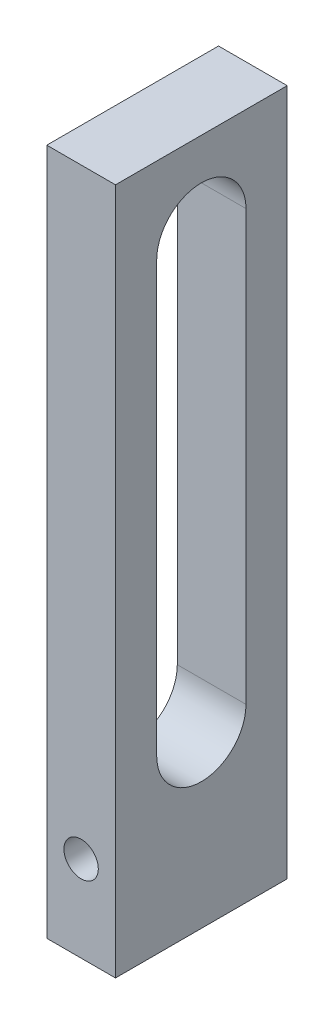
ISO-10303-21;
HEADER;
FILE_DESCRIPTION(('STEP AP214'),'2;1');
FILE_NAME('part.step','',(''),(''),'','','');
FILE_SCHEMA(('AUTOMOTIVE_DESIGN { 1 0 10303 214 1 1 1 1 }'));
ENDSEC;
DATA;
#1=APPLICATION_CONTEXT('core data for automotive mechanical design processes');
#2=APPLICATION_PROTOCOL_DEFINITION('international standard','automotive_design',2000,#1);
#3=PRODUCT_CONTEXT('',#1,'mechanical');
#4=PRODUCT('Part','Part','',(#3));
#5=PRODUCT_RELATED_PRODUCT_CATEGORY('part','',(#4));
#6=PRODUCT_DEFINITION_FORMATION('','',#4);
#7=PRODUCT_DEFINITION_CONTEXT('part definition',#1,'design');
#8=PRODUCT_DEFINITION('design','',#6,#7);
#9=PRODUCT_DEFINITION_SHAPE('','',#8);
#10=(LENGTH_UNIT() NAMED_UNIT(*) SI_UNIT(.MILLI.,.METRE.));
#11=(NAMED_UNIT(*) PLANE_ANGLE_UNIT() SI_UNIT($,.RADIAN.));
#12=(NAMED_UNIT(*) SI_UNIT($,.STERADIAN.) SOLID_ANGLE_UNIT());
#13=UNCERTAINTY_MEASURE_WITH_UNIT(LENGTH_MEASURE(1.E-05),#10,'distance_accuracy_value','');
#14=(GEOMETRIC_REPRESENTATION_CONTEXT(3) GLOBAL_UNCERTAINTY_ASSIGNED_CONTEXT((#13)) GLOBAL_UNIT_ASSIGNED_CONTEXT((#10,
#11,#12)) REPRESENTATION_CONTEXT('',''));
#15=CARTESIAN_POINT('',(0.,0.,0.));
#16=DIRECTION('',(0.,0.,1.));
#17=DIRECTION('',(1.,0.,0.));
#18=AXIS2_PLACEMENT_3D('',#15,#16,#17);
#19=CARTESIAN_POINT('',(0.,0.,10.));
#20=DIRECTION('',(0.,0.,-1.));
#21=DIRECTION('',(-1.,0.,0.));
#22=AXIS2_PLACEMENT_3D('',#19,#20,#21);
#23=PLANE('',#22);
#24=DIRECTION('',(0.,-1.,0.));
#25=VECTOR('',#24,1.);
#26=CARTESIAN_POINT('',(-4.,-10.,10.));
#27=LINE('',#26,#25);
#28=CARTESIAN_POINT('',(-4.,70.,10.));
#29=VERTEX_POINT('',#28);
#30=CARTESIAN_POINT('',(-4.,-10.,10.));
#31=VERTEX_POINT('',#30);
#32=EDGE_CURVE('E210',#29,#31,#27,.T.);
#33=ORIENTED_EDGE('',*,*,#32,.T.);
#34=DIRECTION('',(1.,0.,0.));
#35=VECTOR('',#34,1.);
#36=CARTESIAN_POINT('',(-4.,-10.,10.));
#37=LINE('',#36,#35);
#38=CARTESIAN_POINT('',(4.,-10.,10.));
#39=VERTEX_POINT('',#38);
#40=EDGE_CURVE('E222',#31,#39,#37,.T.);
#41=ORIENTED_EDGE('',*,*,#40,.T.);
#42=DIRECTION('',(0.,1.,0.));
#43=VECTOR('',#42,1.);
#44=CARTESIAN_POINT('',(4.,-10.,10.));
#45=LINE('',#44,#43);
#46=CARTESIAN_POINT('',(4.,70.,10.));
#47=VERTEX_POINT('',#46);
#48=EDGE_CURVE('E204',#39,#47,#45,.T.);
#49=ORIENTED_EDGE('',*,*,#48,.T.);
#50=DIRECTION('',(-1.,0.,0.));
#51=VECTOR('',#50,1.);
#52=CARTESIAN_POINT('',(-4.,70.,10.));
#53=LINE('',#52,#51);
#54=EDGE_CURVE('E217',#47,#29,#53,.T.);
#55=ORIENTED_EDGE('',*,*,#54,.T.);
#56=EDGE_LOOP('',(#33,#41,#49,#55));
#57=FACE_BOUND('',#56,.T.);
#58=CARTESIAN_POINT('',(0.,0.,10.));
#59=DIRECTION('',(0.,0.,1.));
#60=DIRECTION('',(1.,0.,0.));
#61=AXIS2_PLACEMENT_3D('',#58,#59,#60);
#62=CIRCLE('',#61,2.);
#63=CARTESIAN_POINT('',(2.,0.,10.));
#64=VERTEX_POINT('',#63);
#65=EDGE_CURVE('E145',#64,#64,#62,.T.);
#66=ORIENTED_EDGE('',*,*,#65,.F.);
#67=EDGE_LOOP('',(#66));
#68=FACE_BOUND('',#67,.T.);
#69=ADVANCED_FACE('F33',(#57,#68),#23,.F.);
#70=CARTESIAN_POINT('',(0.,0.,-10.));
#71=DIRECTION('',(0.,0.,-1.));
#72=DIRECTION('',(-1.,0.,0.));
#73=AXIS2_PLACEMENT_3D('',#70,#71,#72);
#74=PLANE('',#73);
#75=DIRECTION('',(0.,-1.,0.));
#76=VECTOR('',#75,1.);
#77=CARTESIAN_POINT('',(-4.,-10.,-10.));
#78=LINE('',#77,#76);
#79=CARTESIAN_POINT('',(-4.,70.,-10.));
#80=VERTEX_POINT('',#79);
#81=CARTESIAN_POINT('',(-4.,-10.,-10.));
#82=VERTEX_POINT('',#81);
#83=EDGE_CURVE('E200',#80,#82,#78,.T.);
#84=ORIENTED_EDGE('',*,*,#83,.F.);
#85=DIRECTION('',(-1.,0.,0.));
#86=VECTOR('',#85,1.);
#87=CARTESIAN_POINT('',(-4.,70.,-10.));
#88=LINE('',#87,#86);
#89=CARTESIAN_POINT('',(4.,70.,-10.));
#90=VERTEX_POINT('',#89);
#91=EDGE_CURVE('E208',#90,#80,#88,.T.);
#92=ORIENTED_EDGE('',*,*,#91,.F.);
#93=DIRECTION('',(0.,1.,0.));
#94=VECTOR('',#93,1.);
#95=CARTESIAN_POINT('',(4.,-10.,-10.));
#96=LINE('',#95,#94);
#97=CARTESIAN_POINT('',(4.,-10.,-10.));
#98=VERTEX_POINT('',#97);
#99=EDGE_CURVE('E199',#98,#90,#96,.T.);
#100=ORIENTED_EDGE('',*,*,#99,.F.);
#101=DIRECTION('',(1.,0.,0.));
#102=VECTOR('',#101,1.);
#103=CARTESIAN_POINT('',(-4.,-10.,-10.));
#104=LINE('',#103,#102);
#105=EDGE_CURVE('E192',#82,#98,#104,.T.);
#106=ORIENTED_EDGE('',*,*,#105,.F.);
#107=EDGE_LOOP('',(#84,#92,#100,#106));
#108=FACE_BOUND('',#107,.T.);
#109=CARTESIAN_POINT('',(0.,0.,-10.));
#110=DIRECTION('',(0.,0.,1.));
#111=DIRECTION('',(1.,0.,0.));
#112=AXIS2_PLACEMENT_3D('',#109,#110,#111);
#113=CIRCLE('',#112,2.);
#114=CARTESIAN_POINT('',(2.,0.,-10.));
#115=VERTEX_POINT('',#114);
#116=EDGE_CURVE('E144',#115,#115,#113,.T.);
#117=ORIENTED_EDGE('',*,*,#116,.T.);
#118=EDGE_LOOP('',(#117));
#119=FACE_BOUND('',#118,.T.);
#120=ADVANCED_FACE('F165',(#108,#119),#74,.T.);
#121=CARTESIAN_POINT('',(-4.,-10.,10.));
#122=DIRECTION('',(1.,0.,0.));
#123=DIRECTION('',(0.,0.,-1.));
#124=AXIS2_PLACEMENT_3D('',#121,#122,#123);
#125=PLANE('',#124);
#126=DIRECTION('',(0.,1.,0.));
#127=VECTOR('',#126,1.);
#128=CARTESIAN_POINT('',(-4.,10.,5.2));
#129=LINE('',#128,#127);
#130=CARTESIAN_POINT('',(-4.,10.,5.2));
#131=VERTEX_POINT('',#130);
#132=CARTESIAN_POINT('',(-4.,60.,5.2));
#133=VERTEX_POINT('',#132);
#134=EDGE_CURVE('E125',#131,#133,#129,.T.);
#135=ORIENTED_EDGE('',*,*,#134,.F.);
#136=CARTESIAN_POINT('',(-4.,10.,0.));
#137=DIRECTION('',(-1.,0.,0.));
#138=DIRECTION('',(0.,0.,1.));
#139=AXIS2_PLACEMENT_3D('',#136,#137,#138);
#140=CIRCLE('',#139,5.2);
#141=CARTESIAN_POINT('',(-4.,10.,-5.2));
#142=VERTEX_POINT('',#141);
#143=EDGE_CURVE('E48',#142,#131,#140,.T.);
#144=ORIENTED_EDGE('',*,*,#143,.F.);
#145=DIRECTION('',(0.,-1.,0.));
#146=VECTOR('',#145,1.);
#147=CARTESIAN_POINT('',(-4.,10.,-5.2));
#148=LINE('',#147,#146);
#149=CARTESIAN_POINT('',(-4.,60.,-5.2));
#150=VERTEX_POINT('',#149);
#151=EDGE_CURVE('E116',#150,#142,#148,.T.);
#152=ORIENTED_EDGE('',*,*,#151,.F.);
#153=CARTESIAN_POINT('',(-4.,60.,0.));
#154=DIRECTION('',(-1.,0.,0.));
#155=DIRECTION('',(0.,0.,1.));
#156=AXIS2_PLACEMENT_3D('',#153,#154,#155);
#157=CIRCLE('',#156,5.2);
#158=EDGE_CURVE('E119',#133,#150,#157,.T.);
#159=ORIENTED_EDGE('',*,*,#158,.F.);
#160=EDGE_LOOP('',(#135,#144,#152,#159));
#161=FACE_BOUND('',#160,.T.);
#162=ORIENTED_EDGE('',*,*,#83,.T.);
#163=DIRECTION('',(0.,0.,-1.));
#164=VECTOR('',#163,1.);
#165=CARTESIAN_POINT('',(-4.,-10.,10.));
#166=LINE('',#165,#164);
#167=EDGE_CURVE('E11',#31,#82,#166,.T.);
#168=ORIENTED_EDGE('',*,*,#167,.F.);
#169=ORIENTED_EDGE('',*,*,#32,.F.);
#170=DIRECTION('',(0.,0.,-1.));
#171=VECTOR('',#170,1.);
#172=CARTESIAN_POINT('',(-4.,70.,10.));
#173=LINE('',#172,#171);
#174=EDGE_CURVE('E214',#29,#80,#173,.T.);
#175=ORIENTED_EDGE('',*,*,#174,.T.);
#176=EDGE_LOOP('',(#162,#168,#169,#175));
#177=FACE_BOUND('',#176,.T.);
#178=ADVANCED_FACE('F35',(#161,#177),#125,.F.);
#179=CARTESIAN_POINT('',(-4.,-10.,10.));
#180=DIRECTION('',(0.,1.,0.));
#181=DIRECTION('',(0.,0.,1.));
#182=AXIS2_PLACEMENT_3D('',#179,#180,#181);
#183=PLANE('',#182);
#184=CARTESIAN_POINT('',(0.,-10.,0.));
#185=DIRECTION('',(0.,-1.,0.));
#186=DIRECTION('',(0.,0.,-1.));
#187=AXIS2_PLACEMENT_3D('',#184,#185,#186);
#188=CIRCLE('',#187,1.25);
#189=CARTESIAN_POINT('',(0.,-10.,-1.25));
#190=VERTEX_POINT('',#189);
#191=EDGE_CURVE('E131',#190,#190,#188,.T.);
#192=ORIENTED_EDGE('',*,*,#191,.F.);
#193=EDGE_LOOP('',(#192));
#194=FACE_BOUND('',#193,.T.);
#195=ORIENTED_EDGE('',*,*,#105,.T.);
#196=DIRECTION('',(0.,0.,-1.));
#197=VECTOR('',#196,1.);
#198=CARTESIAN_POINT('',(4.,-10.,10.));
#199=LINE('',#198,#197);
#200=EDGE_CURVE('E41',#39,#98,#199,.T.);
#201=ORIENTED_EDGE('',*,*,#200,.F.);
#202=ORIENTED_EDGE('',*,*,#40,.F.);
#203=ORIENTED_EDGE('',*,*,#167,.T.);
#204=EDGE_LOOP('',(#195,#201,#202,#203));
#205=FACE_BOUND('',#204,.T.);
#206=ADVANCED_FACE('F182',(#194,#205),#183,.F.);
#207=CARTESIAN_POINT('',(4.,-10.,10.));
#208=DIRECTION('',(-1.,0.,0.));
#209=DIRECTION('',(0.,0.,1.));
#210=AXIS2_PLACEMENT_3D('',#207,#208,#209);
#211=PLANE('',#210);
#212=DIRECTION('',(0.,-1.,0.));
#213=VECTOR('',#212,1.);
#214=CARTESIAN_POINT('',(4.,10.,-5.2));
#215=LINE('',#214,#213);
#216=CARTESIAN_POINT('',(4.,60.,-5.2));
#217=VERTEX_POINT('',#216);
#218=CARTESIAN_POINT('',(4.,10.,-5.2));
#219=VERTEX_POINT('',#218);
#220=EDGE_CURVE('E106',#217,#219,#215,.T.);
#221=ORIENTED_EDGE('',*,*,#220,.T.);
#222=CARTESIAN_POINT('',(4.,10.,0.));
#223=DIRECTION('',(-1.,0.,0.));
#224=DIRECTION('',(0.,0.,1.));
#225=AXIS2_PLACEMENT_3D('',#222,#223,#224);
#226=CIRCLE('',#225,5.2);
#227=CARTESIAN_POINT('',(4.,10.,5.2));
#228=VERTEX_POINT('',#227);
#229=EDGE_CURVE('E100',#219,#228,#226,.T.);
#230=ORIENTED_EDGE('',*,*,#229,.T.);
#231=DIRECTION('',(0.,1.,0.));
#232=VECTOR('',#231,1.);
#233=CARTESIAN_POINT('',(4.,10.,5.2));
#234=LINE('',#233,#232);
#235=CARTESIAN_POINT('',(4.,60.,5.2));
#236=VERTEX_POINT('',#235);
#237=EDGE_CURVE('E109',#228,#236,#234,.T.);
#238=ORIENTED_EDGE('',*,*,#237,.T.);
#239=CARTESIAN_POINT('',(4.,60.,0.));
#240=DIRECTION('',(-1.,0.,0.));
#241=DIRECTION('',(0.,0.,1.));
#242=AXIS2_PLACEMENT_3D('',#239,#240,#241);
#243=CIRCLE('',#242,5.2);
#244=EDGE_CURVE('E56',#236,#217,#243,.T.);
#245=ORIENTED_EDGE('',*,*,#244,.T.);
#246=EDGE_LOOP('',(#221,#230,#238,#245));
#247=FACE_BOUND('',#246,.T.);
#248=ORIENTED_EDGE('',*,*,#99,.T.);
#249=DIRECTION('',(0.,0.,-1.));
#250=VECTOR('',#249,1.);
#251=CARTESIAN_POINT('',(4.,70.,10.));
#252=LINE('',#251,#250);
#253=EDGE_CURVE('E205',#47,#90,#252,.T.);
#254=ORIENTED_EDGE('',*,*,#253,.F.);
#255=ORIENTED_EDGE('',*,*,#48,.F.);
#256=ORIENTED_EDGE('',*,*,#200,.T.);
#257=EDGE_LOOP('',(#248,#254,#255,#256));
#258=FACE_BOUND('',#257,.T.);
#259=ADVANCED_FACE('F113',(#247,#258),#211,.F.);
#260=CARTESIAN_POINT('',(-4.,70.,10.));
#261=DIRECTION('',(0.,-1.,0.));
#262=DIRECTION('',(0.,0.,-1.));
#263=AXIS2_PLACEMENT_3D('',#260,#261,#262);
#264=PLANE('',#263);
#265=ORIENTED_EDGE('',*,*,#91,.T.);
#266=ORIENTED_EDGE('',*,*,#174,.F.);
#267=ORIENTED_EDGE('',*,*,#54,.F.);
#268=ORIENTED_EDGE('',*,*,#253,.T.);
#269=EDGE_LOOP('',(#265,#266,#267,#268));
#270=FACE_BOUND('',#269,.T.);
#271=ADVANCED_FACE('F177',(#270),#264,.F.);
#272=CARTESIAN_POINT('',(0.,0.,10.));
#273=DIRECTION('',(0.,0.,-1.));
#274=DIRECTION('',(-1.,0.,0.));
#275=AXIS2_PLACEMENT_3D('',#272,#273,#274);
#276=CYLINDRICAL_SURFACE('',#275,2.);
#277=CARTESIAN_POINT('',(0.,-2.,-1.25));
#278=CARTESIAN_POINT('',(0.0635104730002027,-1.99999595305313,-1.24999565000122));
#279=CARTESIAN_POINT('',(0.127096441053758,-1.99694323311001,-1.24512698818219));
#280=CARTESIAN_POINT('',(0.252318262265282,-1.98502167724102,-1.2259141965705));
#281=CARTESIAN_POINT('',(0.313950163299073,-1.97614175574896,-1.21155200607452));
#282=CARTESIAN_POINT('',(0.433205558136783,-1.95345852982134,-1.17418863683795));
#283=CARTESIAN_POINT('',(0.490847243665017,-1.93967960778663,-1.15123021215912));
#284=CARTESIAN_POINT('',(0.60126036886836,-1.90834598486073,-1.09761414920325));
#285=CARTESIAN_POINT('',(0.654032347276152,-1.89079170235271,-1.06695736399081));
#286=CARTESIAN_POINT('',(0.757974192167973,-1.85170152902273,-0.996113426815027));
#287=CARTESIAN_POINT('',(0.808679560769977,-1.82995962224617,-0.95536070002455));
#288=CARTESIAN_POINT('',(0.902986375146759,-1.78531349913632,-0.866780825493448));
#289=CARTESIAN_POINT('',(0.946578107215733,-1.76240774858553,-0.818944171742062));
#290=CARTESIAN_POINT('',(1.03142873237132,-1.71430418655199,-0.709966105795484));
#291=CARTESIAN_POINT('',(1.07157206029151,-1.68921610993412,-0.647900213392723));
#292=CARTESIAN_POINT('',(1.14073966020039,-1.64330198128731,-0.516435184552815));
#293=CARTESIAN_POINT('',(1.16978270899534,-1.62246875996238,-0.447048687423921));
#294=CARTESIAN_POINT('',(1.20933400585981,-1.59309575627364,-0.321189476221283));
#295=CARTESIAN_POINT('',(1.22269552371393,-1.58276905990074,-0.266033181461183));
#296=CARTESIAN_POINT('',(1.2418184358548,-1.56781357325806,-0.153694074389204));
#297=CARTESIAN_POINT('',(1.24759056342088,-1.56317673673692,-0.0965142417255134));
#298=CARTESIAN_POINT('',(1.2511891824572,-1.56029885782827,0.018413016751119));
#299=CARTESIAN_POINT('',(1.24899483727851,-1.56207458771719,0.076161536462398));
#300=CARTESIAN_POINT('',(1.23676317046804,-1.5717740238392,0.190310103188958));
#301=CARTESIAN_POINT('',(1.22671956265043,-1.5797026576711,0.246709032039081));
#302=CARTESIAN_POINT('',(1.19968103371474,-1.60032573121781,0.355438452657477));
#303=CARTESIAN_POINT('',(1.18285016736897,-1.61290715104814,0.407832455684269));
#304=CARTESIAN_POINT('',(1.14290189820938,-1.64145566443406,0.509161182405421));
#305=CARTESIAN_POINT('',(1.11978227193696,-1.65742395501353,0.558094674874495));
#306=CARTESIAN_POINT('',(1.06294892954949,-1.6945481599302,0.660833273832737));
#307=CARTESIAN_POINT('',(1.0280629660117,-1.71611591575959,0.713840810120391));
#308=CARTESIAN_POINT('',(0.950881463002102,-1.76005711791243,0.813830279000476));
#309=CARTESIAN_POINT('',(0.908578308011438,-1.78243137335976,0.860805931706517));
#310=CARTESIAN_POINT('',(0.809519713023332,-1.82979894916857,0.955301749370393));
#311=CARTESIAN_POINT('',(0.751531353595334,-1.85461531676593,1.00163297425883));
#312=CARTESIAN_POINT('',(0.62714809959357,-1.90028055062445,1.08385089588725));
#313=CARTESIAN_POINT('',(0.560756523882,-1.92113097514764,1.11974169772893));
#314=CARTESIAN_POINT('',(0.424883562934749,-1.95553372961316,1.17776368838142));
#315=CARTESIAN_POINT('',(0.355763457732371,-1.96941976591574,1.20053403998118));
#316=CARTESIAN_POINT('',(0.213612154574977,-1.98984929310048,1.23376492798281));
#317=CARTESIAN_POINT('',(0.140586648341305,-1.9964031799007,1.244242894222));
#318=CARTESIAN_POINT('',(0.00451561874058934,-2.00097840540091,1.2515658500612));
#319=CARTESIAN_POINT('',(-0.0584027741637841,-2.00012161345511,1.25020317795386));
#320=CARTESIAN_POINT('',(-0.182972117996309,-1.99258901494327,1.23811717157928));
#321=CARTESIAN_POINT('',(-0.244623154962733,-1.98591360473591,1.22739447490784));
#322=CARTESIAN_POINT('',(-0.362521070658189,-1.9677405228307,1.19776146330804));
#323=CARTESIAN_POINT('',(-0.418885009953203,-1.95644170526844,1.17918784320335));
#324=CARTESIAN_POINT('',(-0.527638281070987,-1.92995684104751,1.13470361072143));
#325=CARTESIAN_POINT('',(-0.580026945470714,-1.91477014350266,1.10879176974485));
#326=CARTESIAN_POINT('',(-0.685084056277256,-1.87990012356,1.04748479400452));
#327=CARTESIAN_POINT('',(-0.737246967843404,-1.85991764817225,1.01139643076176));
#328=CARTESIAN_POINT('',(-0.83514264021734,-1.81806970001717,0.932206134847193));
#329=CARTESIAN_POINT('',(-0.880868151291854,-1.79620214826384,0.889096410745464));
#330=CARTESIAN_POINT('',(-0.971474198022883,-1.74905869713091,0.78986496058735));
#331=CARTESIAN_POINT('',(-1.01526851939752,-1.72374883414957,0.732762793705218));
#332=CARTESIAN_POINT('',(-1.09280351885684,-1.67566762748172,0.611124215055745));
#333=CARTESIAN_POINT('',(-1.12655115718693,-1.65289453322336,0.54659299324701));
#334=CARTESIAN_POINT('',(-1.17684772011828,-1.61733530314592,0.425307851943124));
#335=CARTESIAN_POINT('',(-1.19551895865479,-1.6034563619378,0.369759249267781));
#336=CARTESIAN_POINT('',(-1.22500108205245,-1.58105030663767,0.255606854231083));
#337=CARTESIAN_POINT('',(-1.23582424983127,-1.57251483242606,0.19700799054854));
#338=CARTESIAN_POINT('',(-1.24901383653654,-1.56206324988732,0.0779097231193144));
#339=CARTESIAN_POINT('',(-1.25133186963292,-1.56018501674569,0.0174014145118274));
#340=CARTESIAN_POINT('',(-1.24719778716818,-1.56349063109847,-0.103130960366036));
#341=CARTESIAN_POINT('',(-1.24074275650143,-1.56867682595586,-0.163154859009513));
#342=CARTESIAN_POINT('',(-1.22038272403399,-1.58455388771334,-0.276029795051359));
#343=CARTESIAN_POINT('',(-1.2071191949977,-1.5947680805106,-0.329069301416411));
#344=CARTESIAN_POINT('',(-1.17417623469513,-1.6191753043569,-0.432135059585906));
#345=CARTESIAN_POINT('',(-1.15449412799407,-1.63336999423727,-0.482160044537503));
#346=CARTESIAN_POINT('',(-1.10602690439618,-1.66663902886518,-0.585596743872699));
#347=CARTESIAN_POINT('',(-1.0763364445546,-1.68612230498997,-0.638450298476552));
#348=CARTESIAN_POINT('',(-1.0100001703639,-1.72667706411868,-0.738938367246004));
#349=CARTESIAN_POINT('',(-0.973348732866944,-1.74774982276825,-0.786568612560479));
#350=CARTESIAN_POINT('',(-0.885670221416064,-1.79401910731181,-0.885014254977839));
#351=CARTESIAN_POINT('',(-0.833233674246798,-1.81920541808776,-0.934590845445481));
#352=CARTESIAN_POINT('',(-0.719822446025208,-1.86698729056748,-1.02449482970524));
#353=CARTESIAN_POINT('',(-0.658842515138554,-1.88958124364395,-1.0648164959274));
#354=CARTESIAN_POINT('',(-0.529355399891412,-1.92986710976548,-1.1347711301241));
#355=CARTESIAN_POINT('',(-0.460835727056575,-1.94755071355356,-1.16438600540584));
#356=CARTESIAN_POINT('',(-0.318394712729503,-1.97581521637842,-1.21107188433174));
#357=CARTESIAN_POINT('',(-0.244493501106854,-1.98642121428689,-1.22818723486978));
#358=CARTESIAN_POINT('',(-0.141418481224667,-1.99519472168143,-1.24229920916263));
#359=CARTESIAN_POINT('',(-0.113248608862872,-1.99699172226301,-1.24518186533397));
#360=CARTESIAN_POINT('',(-0.0567241864870911,-1.9993953021324,-1.2490332915376));
#361=CARTESIAN_POINT('',(-0.0283696251514534,-2.00000180773911,-1.25000194310999));
#362=CARTESIAN_POINT('',(0.,-2.,-1.25));
#363=B_SPLINE_CURVE_WITH_KNOTS('',3,(#277,#278,#279,#280,#281,#282,#283,#284,#285,#286,#287,
#288,#289,#290,#291,#292,#293,#294,#295,#296,#297,#298,#299,#300,#301,#302,#303,#304,#305,#306,
#307,#308,#309,#310,#311,#312,#313,#314,#315,#316,#317,#318,#319,#320,#321,#322,#323,#324,#325,
#326,#327,#328,#329,#330,#331,#332,#333,#334,#335,#336,#337,#338,#339,#340,#341,#342,#343,#344,
#345,#346,#347,#348,#349,#350,#351,#352,#353,#354,#355,#356,#357,#358,#359,#360,#361,#362),
.UNSPECIFIED.,.T.,.F.,(4,2,2,2,2,2,2,2,2,2,2,2,2,2,2,2,2,2,2,2,2,2,2,2,2,2,2,2,2,2,2,2,2,2,2,2,
2,2,2,2,2,2,4),(0.,0.190412301434133,0.381187894128462,0.571026987595136,0.760845054038795,
0.965821870536218,1.17107628325702,1.40412975852973,1.6367872460701,1.80912008879717,
1.98120894707391,2.15374823498778,2.32642584505083,2.49515839460437,2.66395067908033,
2.8642745035436,3.06480522575182,3.29842180699522,3.53194640727861,3.75284174135959,
3.97342347958131,4.16127180597573,4.34910733732281,4.52959504531298,4.71011298928466,
4.90885230990552,5.10781368827686,5.33565708863713,5.5633422719691,5.7432994031372,
5.92297427413352,6.103669746882,6.28442527563864,6.4506316903774,6.61690747313442,
6.80725523036979,6.99775741153769,7.22600539035112,7.454394245785,7.68316725607077,
7.91112460944408,7.9961750123248,8.08123067890588),.UNSPECIFIED.);
#364=CARTESIAN_POINT('',(0.,-2.,-1.25));
#365=VERTEX_POINT('',#364);
#366=EDGE_CURVE('E137',#365,#365,#363,.T.);
#367=ORIENTED_EDGE('',*,*,#366,.T.);
#368=EDGE_LOOP('',(#367));
#369=FACE_BOUND('',#368,.T.);
#370=ORIENTED_EDGE('',*,*,#65,.T.);
#371=EDGE_LOOP('',(#370));
#372=FACE_BOUND('',#371,.T.);
#373=ORIENTED_EDGE('',*,*,#116,.F.);
#374=EDGE_LOOP('',(#373));
#375=FACE_BOUND('',#374,.T.);
#376=ADVANCED_FACE('F175',(#369,#372,#375),#276,.F.);
#377=CARTESIAN_POINT('',(0.,70.001,0.));
#378=DIRECTION('',(0.,-1.,0.));
#379=DIRECTION('',(0.,0.,-1.));
#380=AXIS2_PLACEMENT_3D('',#377,#378,#379);
#381=CYLINDRICAL_SURFACE('',#380,1.25);
#382=ORIENTED_EDGE('',*,*,#191,.T.);
#383=EDGE_LOOP('',(#382));
#384=FACE_BOUND('',#383,.T.);
#385=ORIENTED_EDGE('',*,*,#366,.F.);
#386=EDGE_LOOP('',(#385));
#387=FACE_BOUND('',#386,.T.);
#388=ADVANCED_FACE('F147',(#384,#387),#381,.F.);
#389=CARTESIAN_POINT('',(4.,10.,0.));
#390=DIRECTION('',(-1.,0.,0.));
#391=DIRECTION('',(0.,0.,1.));
#392=AXIS2_PLACEMENT_3D('',#389,#390,#391);
#393=CYLINDRICAL_SURFACE('',#392,5.2);
#394=ORIENTED_EDGE('',*,*,#143,.T.);
#395=DIRECTION('',(-1.,0.,0.));
#396=VECTOR('',#395,1.);
#397=CARTESIAN_POINT('',(4.,10.,5.2));
#398=LINE('',#397,#396);
#399=EDGE_CURVE('E96',#228,#131,#398,.T.);
#400=ORIENTED_EDGE('',*,*,#399,.F.);
#401=ORIENTED_EDGE('',*,*,#229,.F.);
#402=DIRECTION('',(-1.,0.,0.));
#403=VECTOR('',#402,1.);
#404=CARTESIAN_POINT('',(4.,10.,-5.2));
#405=LINE('',#404,#403);
#406=EDGE_CURVE('E129',#219,#142,#405,.T.);
#407=ORIENTED_EDGE('',*,*,#406,.T.);
#408=EDGE_LOOP('',(#394,#400,#401,#407));
#409=FACE_BOUND('',#408,.T.);
#410=ADVANCED_FACE('F98',(#409),#393,.F.);
#411=CARTESIAN_POINT('',(4.,10.,-5.2));
#412=DIRECTION('',(0.,0.,-1.));
#413=DIRECTION('',(-1.,0.,0.));
#414=AXIS2_PLACEMENT_3D('',#411,#412,#413);
#415=PLANE('',#414);
#416=ORIENTED_EDGE('',*,*,#151,.T.);
#417=ORIENTED_EDGE('',*,*,#406,.F.);
#418=ORIENTED_EDGE('',*,*,#220,.F.);
#419=DIRECTION('',(-1.,0.,0.));
#420=VECTOR('',#419,1.);
#421=CARTESIAN_POINT('',(4.,60.,-5.2));
#422=LINE('',#421,#420);
#423=EDGE_CURVE('E132',#217,#150,#422,.T.);
#424=ORIENTED_EDGE('',*,*,#423,.T.);
#425=EDGE_LOOP('',(#416,#417,#418,#424));
#426=FACE_BOUND('',#425,.T.);
#427=ADVANCED_FACE('F154',(#426),#415,.F.);
#428=CARTESIAN_POINT('',(4.,60.,0.));
#429=DIRECTION('',(-1.,0.,0.));
#430=DIRECTION('',(0.,0.,1.));
#431=AXIS2_PLACEMENT_3D('',#428,#429,#430);
#432=CYLINDRICAL_SURFACE('',#431,5.2);
#433=ORIENTED_EDGE('',*,*,#158,.T.);
#434=ORIENTED_EDGE('',*,*,#423,.F.);
#435=ORIENTED_EDGE('',*,*,#244,.F.);
#436=DIRECTION('',(-1.,0.,0.));
#437=VECTOR('',#436,1.);
#438=CARTESIAN_POINT('',(4.,60.,5.2));
#439=LINE('',#438,#437);
#440=EDGE_CURVE('E105',#236,#133,#439,.T.);
#441=ORIENTED_EDGE('',*,*,#440,.T.);
#442=EDGE_LOOP('',(#433,#434,#435,#441));
#443=FACE_BOUND('',#442,.T.);
#444=ADVANCED_FACE('F157',(#443),#432,.F.);
#445=CARTESIAN_POINT('',(4.,10.,5.2));
#446=DIRECTION('',(0.,0.,1.));
#447=DIRECTION('',(1.,0.,0.));
#448=AXIS2_PLACEMENT_3D('',#445,#446,#447);
#449=PLANE('',#448);
#450=ORIENTED_EDGE('',*,*,#134,.T.);
#451=ORIENTED_EDGE('',*,*,#440,.F.);
#452=ORIENTED_EDGE('',*,*,#237,.F.);
#453=ORIENTED_EDGE('',*,*,#399,.T.);
#454=EDGE_LOOP('',(#450,#451,#452,#453));
#455=FACE_BOUND('',#454,.T.);
#456=ADVANCED_FACE('F110',(#455),#449,.F.);
#457=CLOSED_SHELL('',(#69,#120,#178,#206,#259,#271,#376,#388,#410,#427,#444,#456));
#458=MANIFOLD_SOLID_BREP('B2',#457);
#459=ADVANCED_BREP_SHAPE_REPRESENTATION('',(#18,#458),#14);
#460=SHAPE_DEFINITION_REPRESENTATION(#9,#459);
ENDSEC;
END-ISO-10303-21;
